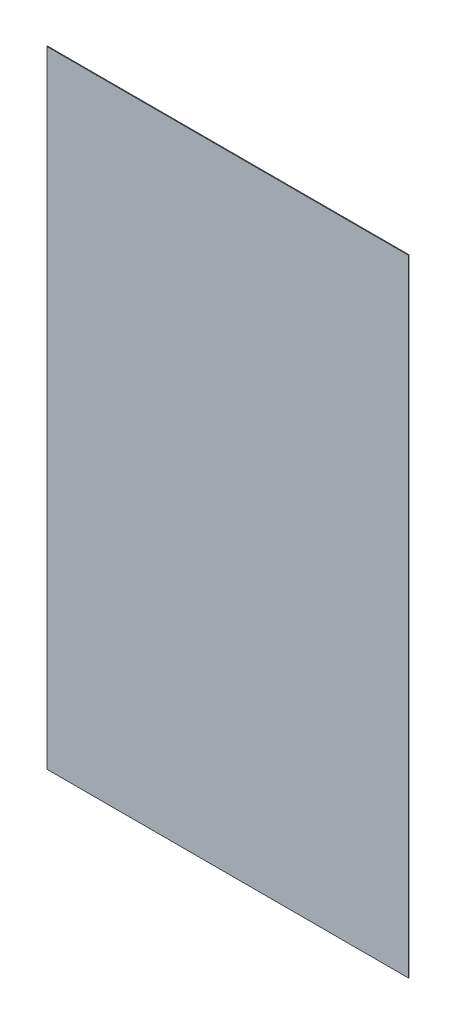
ISO-10303-21;
HEADER;
FILE_DESCRIPTION(('STEP AP214'),'2;1');
FILE_NAME('part.step','',(''),(''),'','','');
FILE_SCHEMA(('AUTOMOTIVE_DESIGN { 1 0 10303 214 1 1 1 1 }'));
ENDSEC;
DATA;
#1=APPLICATION_CONTEXT('core data for automotive mechanical design processes');
#2=APPLICATION_PROTOCOL_DEFINITION('international standard','automotive_design',2000,#1);
#3=PRODUCT_CONTEXT('',#1,'mechanical');
#4=PRODUCT('Part','Part','',(#3));
#5=PRODUCT_RELATED_PRODUCT_CATEGORY('part','',(#4));
#6=PRODUCT_DEFINITION_FORMATION('','',#4);
#7=PRODUCT_DEFINITION_CONTEXT('part definition',#1,'design');
#8=PRODUCT_DEFINITION('design','',#6,#7);
#9=PRODUCT_DEFINITION_SHAPE('','',#8);
#10=(LENGTH_UNIT() NAMED_UNIT(*) SI_UNIT(.MILLI.,.METRE.));
#11=(NAMED_UNIT(*) PLANE_ANGLE_UNIT() SI_UNIT($,.RADIAN.));
#12=(NAMED_UNIT(*) SI_UNIT($,.STERADIAN.) SOLID_ANGLE_UNIT());
#13=UNCERTAINTY_MEASURE_WITH_UNIT(LENGTH_MEASURE(1.E-05),#10,'distance_accuracy_value','');
#14=(GEOMETRIC_REPRESENTATION_CONTEXT(3) GLOBAL_UNCERTAINTY_ASSIGNED_CONTEXT((#13)) GLOBAL_UNIT_ASSIGNED_CONTEXT((#10,
#11,#12)) REPRESENTATION_CONTEXT('',''));
#15=CARTESIAN_POINT('',(0.,0.,0.));
#16=DIRECTION('',(0.,0.,1.));
#17=DIRECTION('',(1.,0.,0.));
#18=AXIS2_PLACEMENT_3D('',#15,#16,#17);
#19=CARTESIAN_POINT('',(203.25,351.75,0.85));
#20=DIRECTION('',(-1.,0.,0.));
#21=DIRECTION('',(0.,-1.,0.));
#22=AXIS2_PLACEMENT_3D('',#19,#20,#21);
#23=PLANE('',#22);
#24=DIRECTION('',(0.,1.,0.));
#25=VECTOR('',#24,1.);
#26=CARTESIAN_POINT('',(203.25,351.75,0.));
#27=LINE('',#26,#25);
#28=CARTESIAN_POINT('',(203.25,-351.75,0.));
#29=VERTEX_POINT('',#28);
#30=CARTESIAN_POINT('',(203.25,351.75,0.));
#31=VERTEX_POINT('',#30);
#32=EDGE_CURVE('E96',#29,#31,#27,.T.);
#33=ORIENTED_EDGE('',*,*,#32,.T.);
#34=DIRECTION('',(0.,0.,-1.));
#35=VECTOR('',#34,1.);
#36=CARTESIAN_POINT('',(203.25,351.75,0.85));
#37=LINE('',#36,#35);
#38=CARTESIAN_POINT('',(203.25,351.75,0.85));
#39=VERTEX_POINT('',#38);
#40=EDGE_CURVE('E11',#39,#31,#37,.T.);
#41=ORIENTED_EDGE('',*,*,#40,.F.);
#42=DIRECTION('',(0.,1.,0.));
#43=VECTOR('',#42,1.);
#44=CARTESIAN_POINT('',(203.25,351.75,0.85));
#45=LINE('',#44,#43);
#46=CARTESIAN_POINT('',(203.25,-351.75,0.85));
#47=VERTEX_POINT('',#46);
#48=EDGE_CURVE('E84',#47,#39,#45,.T.);
#49=ORIENTED_EDGE('',*,*,#48,.F.);
#50=DIRECTION('',(0.,0.,-1.));
#51=VECTOR('',#50,1.);
#52=CARTESIAN_POINT('',(203.25,-351.75,0.85));
#53=LINE('',#52,#51);
#54=EDGE_CURVE('E92',#47,#29,#53,.T.);
#55=ORIENTED_EDGE('',*,*,#54,.T.);
#56=EDGE_LOOP('',(#33,#41,#49,#55));
#57=FACE_BOUND('',#56,.T.);
#58=ADVANCED_FACE('F33',(#57),#23,.F.);
#59=CARTESIAN_POINT('',(-203.25,351.75,0.85));
#60=DIRECTION('',(0.,-1.,0.));
#61=DIRECTION('',(0.,0.,-1.));
#62=AXIS2_PLACEMENT_3D('',#59,#60,#61);
#63=PLANE('',#62);
#64=DIRECTION('',(-1.,0.,0.));
#65=VECTOR('',#64,1.);
#66=CARTESIAN_POINT('',(-203.25,351.75,0.));
#67=LINE('',#66,#65);
#68=CARTESIAN_POINT('',(-203.25,351.75,0.));
#69=VERTEX_POINT('',#68);
#70=EDGE_CURVE('E88',#31,#69,#67,.T.);
#71=ORIENTED_EDGE('',*,*,#70,.T.);
#72=DIRECTION('',(0.,0.,-1.));
#73=VECTOR('',#72,1.);
#74=CARTESIAN_POINT('',(-203.25,351.75,0.85));
#75=LINE('',#74,#73);
#76=CARTESIAN_POINT('',(-203.25,351.75,0.85));
#77=VERTEX_POINT('',#76);
#78=EDGE_CURVE('E41',#77,#69,#75,.T.);
#79=ORIENTED_EDGE('',*,*,#78,.F.);
#80=DIRECTION('',(-1.,0.,0.));
#81=VECTOR('',#80,1.);
#82=CARTESIAN_POINT('',(-203.25,351.75,0.85));
#83=LINE('',#82,#81);
#84=EDGE_CURVE('E79',#39,#77,#83,.T.);
#85=ORIENTED_EDGE('',*,*,#84,.F.);
#86=ORIENTED_EDGE('',*,*,#40,.T.);
#87=EDGE_LOOP('',(#71,#79,#85,#86));
#88=FACE_BOUND('',#87,.T.);
#89=ADVANCED_FACE('F87',(#88),#63,.F.);
#90=CARTESIAN_POINT('',(-203.25,351.75,0.85));
#91=DIRECTION('',(1.,0.,0.));
#92=DIRECTION('',(0.,1.,0.));
#93=AXIS2_PLACEMENT_3D('',#90,#91,#92);
#94=PLANE('',#93);
#95=DIRECTION('',(0.,-1.,0.));
#96=VECTOR('',#95,1.);
#97=CARTESIAN_POINT('',(-203.25,351.75,0.));
#98=LINE('',#97,#96);
#99=CARTESIAN_POINT('',(-203.25,-351.75,0.));
#100=VERTEX_POINT('',#99);
#101=EDGE_CURVE('E66',#69,#100,#98,.T.);
#102=ORIENTED_EDGE('',*,*,#101,.T.);
#103=DIRECTION('',(0.,0.,-1.));
#104=VECTOR('',#103,1.);
#105=CARTESIAN_POINT('',(-203.25,-351.75,0.85));
#106=LINE('',#105,#104);
#107=CARTESIAN_POINT('',(-203.25,-351.75,0.85));
#108=VERTEX_POINT('',#107);
#109=EDGE_CURVE('E89',#108,#100,#106,.T.);
#110=ORIENTED_EDGE('',*,*,#109,.F.);
#111=DIRECTION('',(0.,-1.,0.));
#112=VECTOR('',#111,1.);
#113=CARTESIAN_POINT('',(-203.25,351.75,0.85));
#114=LINE('',#113,#112);
#115=EDGE_CURVE('E82',#77,#108,#114,.T.);
#116=ORIENTED_EDGE('',*,*,#115,.F.);
#117=ORIENTED_EDGE('',*,*,#78,.T.);
#118=EDGE_LOOP('',(#102,#110,#116,#117));
#119=FACE_BOUND('',#118,.T.);
#120=ADVANCED_FACE('F90',(#119),#94,.F.);
#121=CARTESIAN_POINT('',(-203.25,-351.75,0.85));
#122=DIRECTION('',(0.,1.,0.));
#123=DIRECTION('',(0.,0.,1.));
#124=AXIS2_PLACEMENT_3D('',#121,#122,#123);
#125=PLANE('',#124);
#126=DIRECTION('',(1.,0.,0.));
#127=VECTOR('',#126,1.);
#128=CARTESIAN_POINT('',(-203.25,-351.75,0.));
#129=LINE('',#128,#127);
#130=EDGE_CURVE('E72',#100,#29,#129,.T.);
#131=ORIENTED_EDGE('',*,*,#130,.T.);
#132=ORIENTED_EDGE('',*,*,#54,.F.);
#133=DIRECTION('',(1.,0.,0.));
#134=VECTOR('',#133,1.);
#135=CARTESIAN_POINT('',(-203.25,-351.75,0.85));
#136=LINE('',#135,#134);
#137=EDGE_CURVE('E49',#108,#47,#136,.T.);
#138=ORIENTED_EDGE('',*,*,#137,.F.);
#139=ORIENTED_EDGE('',*,*,#109,.T.);
#140=EDGE_LOOP('',(#131,#132,#138,#139));
#141=FACE_BOUND('',#140,.T.);
#142=ADVANCED_FACE('F103',(#141),#125,.F.);
#143=CARTESIAN_POINT('',(0.,0.,0.85));
#144=DIRECTION('',(0.,0.,1.));
#145=DIRECTION('',(1.,0.,0.));
#146=AXIS2_PLACEMENT_3D('',#143,#144,#145);
#147=PLANE('',#146);
#148=ORIENTED_EDGE('',*,*,#48,.T.);
#149=ORIENTED_EDGE('',*,*,#84,.T.);
#150=ORIENTED_EDGE('',*,*,#115,.T.);
#151=ORIENTED_EDGE('',*,*,#137,.T.);
#152=EDGE_LOOP('',(#148,#149,#150,#151));
#153=FACE_BOUND('',#152,.T.);
#154=ADVANCED_FACE('F80',(#153),#147,.T.);
#155=CARTESIAN_POINT('',(0.,0.,0.));
#156=DIRECTION('',(0.,0.,1.));
#157=DIRECTION('',(1.,0.,0.));
#158=AXIS2_PLACEMENT_3D('',#155,#156,#157);
#159=PLANE('',#158);
#160=ORIENTED_EDGE('',*,*,#32,.F.);
#161=ORIENTED_EDGE('',*,*,#130,.F.);
#162=ORIENTED_EDGE('',*,*,#101,.F.);
#163=ORIENTED_EDGE('',*,*,#70,.F.);
#164=EDGE_LOOP('',(#160,#161,#162,#163));
#165=FACE_BOUND('',#164,.T.);
#166=ADVANCED_FACE('F106',(#165),#159,.F.);
#167=CLOSED_SHELL('',(#58,#89,#120,#142,#154,#166));
#168=MANIFOLD_SOLID_BREP('B2',#167);
#169=ADVANCED_BREP_SHAPE_REPRESENTATION('',(#18,#168),#14);
#170=SHAPE_DEFINITION_REPRESENTATION(#9,#169);
ENDSEC;
END-ISO-10303-21;
